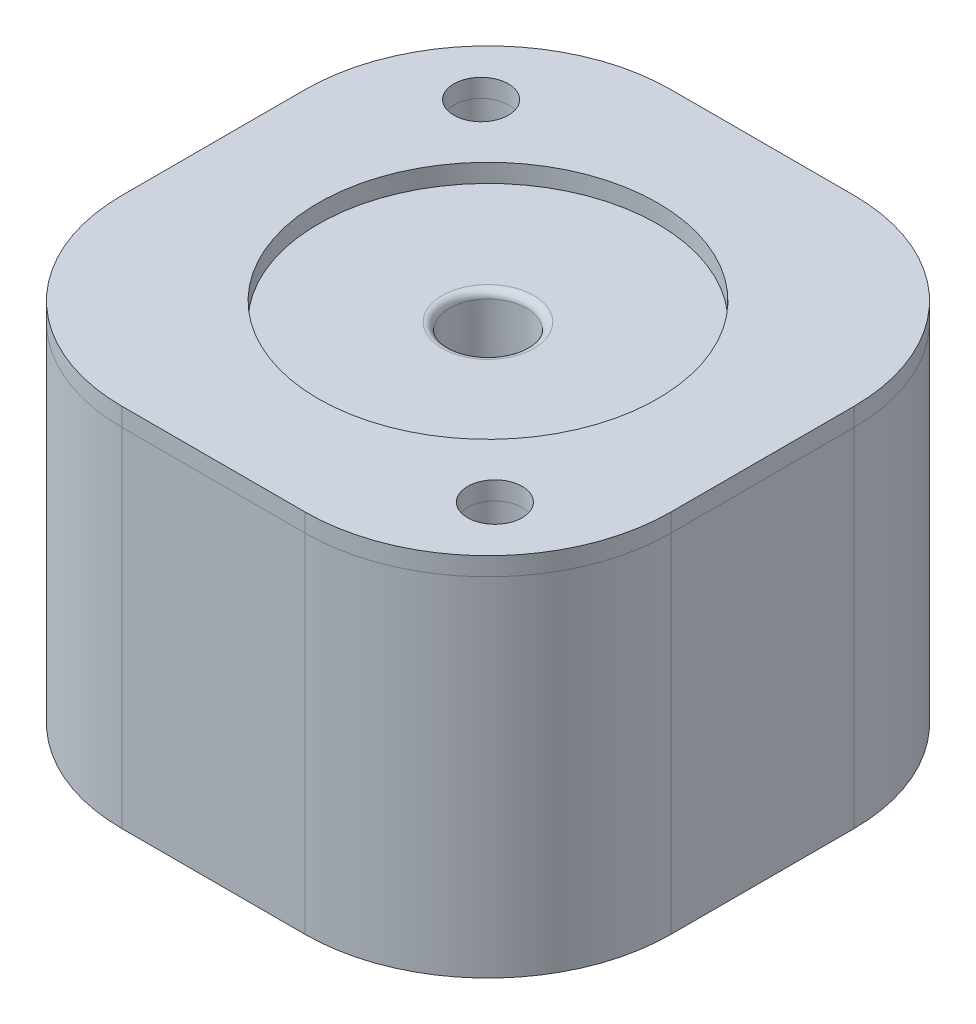
ISO-10303-21;
HEADER;
FILE_DESCRIPTION(('STEP AP214'),'2;1');
FILE_NAME('part.step','',(''),(''),'','','');
FILE_SCHEMA(('AUTOMOTIVE_DESIGN { 1 0 10303 214 1 1 1 1 }'));
ENDSEC;
DATA;
#1=APPLICATION_CONTEXT('core data for automotive mechanical design processes');
#2=APPLICATION_PROTOCOL_DEFINITION('international standard','automotive_design',2000,#1);
#3=PRODUCT_CONTEXT('',#1,'mechanical');
#4=PRODUCT('Part','Part','',(#3));
#5=PRODUCT_RELATED_PRODUCT_CATEGORY('part','',(#4));
#6=PRODUCT_DEFINITION_FORMATION('','',#4);
#7=PRODUCT_DEFINITION_CONTEXT('part definition',#1,'design');
#8=PRODUCT_DEFINITION('design','',#6,#7);
#9=PRODUCT_DEFINITION_SHAPE('','',#8);
#10=(LENGTH_UNIT() NAMED_UNIT(*) SI_UNIT(.MILLI.,.METRE.));
#11=(NAMED_UNIT(*) PLANE_ANGLE_UNIT() SI_UNIT($,.RADIAN.));
#12=(NAMED_UNIT(*) SI_UNIT($,.STERADIAN.) SOLID_ANGLE_UNIT());
#13=UNCERTAINTY_MEASURE_WITH_UNIT(LENGTH_MEASURE(1.E-05),#10,'distance_accuracy_value','');
#14=(GEOMETRIC_REPRESENTATION_CONTEXT(3) GLOBAL_UNCERTAINTY_ASSIGNED_CONTEXT((#13)) GLOBAL_UNIT_ASSIGNED_CONTEXT((#10,
#11,#12)) REPRESENTATION_CONTEXT('',''));
#15=CARTESIAN_POINT('',(0.,0.,0.));
#16=DIRECTION('',(0.,0.,1.));
#17=DIRECTION('',(1.,0.,0.));
#18=AXIS2_PLACEMENT_3D('',#15,#16,#17);
#19=CARTESIAN_POINT('',(-15.,19.,-15.01));
#20=DIRECTION('',(0.,-1.,0.));
#21=DIRECTION('',(0.,0.,-1.));
#22=AXIS2_PLACEMENT_3D('',#19,#20,#21);
#23=PLANE('',#22);
#24=CARTESIAN_POINT('',(0.,19.,0.));
#25=DIRECTION('',(0.,-1.,0.));
#26=DIRECTION('',(0.,0.,-1.));
#27=AXIS2_PLACEMENT_3D('',#24,#25,#26);
#28=CIRCLE('',#27,9.27774999999996);
#29=CARTESIAN_POINT('',(0.,19.,-9.27774999999995));
#30=VERTEX_POINT('',#29);
#31=EDGE_CURVE('E154',#30,#30,#28,.F.);
#32=ORIENTED_EDGE('',*,*,#31,.T.);
#33=EDGE_LOOP('',(#32));
#34=FACE_BOUND('',#33,.T.);
#35=CARTESIAN_POINT('',(-5.,19.,-4.99999999999999));
#36=DIRECTION('',(0.,-1.,0.));
#37=DIRECTION('',(0.,0.,-1.));
#38=AXIS2_PLACEMENT_3D('',#35,#36,#37);
#39=CIRCLE('',#38,10.);
#40=CARTESIAN_POINT('',(-5.,19.,-15.));
#41=VERTEX_POINT('',#40);
#42=CARTESIAN_POINT('',(-15.,19.,-4.99999999999999));
#43=VERTEX_POINT('',#42);
#44=EDGE_CURVE('E111',#41,#43,#39,.F.);
#45=ORIENTED_EDGE('',*,*,#44,.F.);
#46=DIRECTION('',(1.,0.,0.));
#47=VECTOR('',#46,1.);
#48=CARTESIAN_POINT('',(15.,19.,-15.));
#49=LINE('',#48,#47);
#50=CARTESIAN_POINT('',(4.99999999999999,19.,-15.));
#51=VERTEX_POINT('',#50);
#52=EDGE_CURVE('E157',#41,#51,#49,.T.);
#53=ORIENTED_EDGE('',*,*,#52,.T.);
#54=CARTESIAN_POINT('',(5.,19.,-4.99999999999999));
#55=DIRECTION('',(0.,-1.,0.));
#56=DIRECTION('',(0.,0.,-1.));
#57=AXIS2_PLACEMENT_3D('',#54,#55,#56);
#58=CIRCLE('',#57,10.);
#59=CARTESIAN_POINT('',(15.,19.,-4.99999999999999));
#60=VERTEX_POINT('',#59);
#61=EDGE_CURVE('E120',#60,#51,#58,.F.);
#62=ORIENTED_EDGE('',*,*,#61,.F.);
#63=DIRECTION('',(0.,0.,1.));
#64=VECTOR('',#63,1.);
#65=CARTESIAN_POINT('',(15.,19.,-15.));
#66=LINE('',#65,#64);
#67=CARTESIAN_POINT('',(15.,19.,5.));
#68=VERTEX_POINT('',#67);
#69=EDGE_CURVE('E159',#60,#68,#66,.T.);
#70=ORIENTED_EDGE('',*,*,#69,.T.);
#71=CARTESIAN_POINT('',(5.,19.,5.00000000000001));
#72=DIRECTION('',(0.,-1.,0.));
#73=DIRECTION('',(0.,0.,-1.));
#74=AXIS2_PLACEMENT_3D('',#71,#72,#73);
#75=CIRCLE('',#74,10.);
#76=CARTESIAN_POINT('',(5.,19.,15.));
#77=VERTEX_POINT('',#76);
#78=EDGE_CURVE('E147',#77,#68,#75,.F.);
#79=ORIENTED_EDGE('',*,*,#78,.F.);
#80=DIRECTION('',(-1.,0.,0.));
#81=VECTOR('',#80,1.);
#82=CARTESIAN_POINT('',(15.,19.,15.));
#83=LINE('',#82,#81);
#84=CARTESIAN_POINT('',(-5.,19.,15.));
#85=VERTEX_POINT('',#84);
#86=EDGE_CURVE('E126',#77,#85,#83,.T.);
#87=ORIENTED_EDGE('',*,*,#86,.T.);
#88=CARTESIAN_POINT('',(-5.,19.,5.00000000000001));
#89=DIRECTION('',(0.,-1.,0.));
#90=DIRECTION('',(0.,0.,-1.));
#91=AXIS2_PLACEMENT_3D('',#88,#89,#90);
#92=CIRCLE('',#91,10.);
#93=CARTESIAN_POINT('',(-15.,19.,5.00000000000001));
#94=VERTEX_POINT('',#93);
#95=EDGE_CURVE('E125',#94,#85,#92,.F.);
#96=ORIENTED_EDGE('',*,*,#95,.F.);
#97=DIRECTION('',(0.,0.,-1.));
#98=VECTOR('',#97,1.);
#99=CARTESIAN_POINT('',(-15.,19.,-15.));
#100=LINE('',#99,#98);
#101=EDGE_CURVE('E121',#94,#43,#100,.T.);
#102=ORIENTED_EDGE('',*,*,#101,.T.);
#103=EDGE_LOOP('',(#45,#53,#62,#70,#79,#87,#96,#102));
#104=FACE_BOUND('',#103,.T.);
#105=CARTESIAN_POINT('',(9.71815906597584,19.,9.34105517720241));
#106=DIRECTION('',(0.,-1.,0.));
#107=DIRECTION('',(0.,0.,-1.));
#108=AXIS2_PLACEMENT_3D('',#105,#106,#107);
#109=CIRCLE('',#108,1.49);
#110=CARTESIAN_POINT('',(9.71815906597584,19.,7.85105517720241));
#111=VERTEX_POINT('',#110);
#112=EDGE_CURVE('E148',#111,#111,#109,.F.);
#113=ORIENTED_EDGE('',*,*,#112,.T.);
#114=EDGE_LOOP('',(#113));
#115=FACE_BOUND('',#114,.T.);
#116=CARTESIAN_POINT('',(-9.71815906597584,19.,-9.34105517720241));
#117=DIRECTION('',(0.,-1.,0.));
#118=DIRECTION('',(0.,0.,-1.));
#119=AXIS2_PLACEMENT_3D('',#116,#117,#118);
#120=CIRCLE('',#119,1.49);
#121=CARTESIAN_POINT('',(-9.71815906597584,19.,-10.8310551772024));
#122=VERTEX_POINT('',#121);
#123=EDGE_CURVE('E151',#122,#122,#120,.F.);
#124=ORIENTED_EDGE('',*,*,#123,.T.);
#125=EDGE_LOOP('',(#124));
#126=FACE_BOUND('',#125,.T.);
#127=ADVANCED_FACE('F43',(#34,#104,#115,#126),#23,.T.);
#128=CARTESIAN_POINT('',(15.,20.,-15.));
#129=DIRECTION('',(0.,0.,1.));
#130=DIRECTION('',(1.,0.,0.));
#131=AXIS2_PLACEMENT_3D('',#128,#129,#130);
#132=PLANE('',#131);
#133=ORIENTED_EDGE('',*,*,#52,.F.);
#134=DIRECTION('',(0.,-1.,0.));
#135=VECTOR('',#134,1.);
#136=CARTESIAN_POINT('',(-5.,20.,-15.));
#137=LINE('',#136,#135);
#138=CARTESIAN_POINT('',(-5.,20.,-15.));
#139=VERTEX_POINT('',#138);
#140=EDGE_CURVE('E116',#41,#139,#137,.F.);
#141=ORIENTED_EDGE('',*,*,#140,.T.);
#142=DIRECTION('',(-1.,0.,0.));
#143=VECTOR('',#142,1.);
#144=CARTESIAN_POINT('',(15.,20.,-15.));
#145=LINE('',#144,#143);
#146=CARTESIAN_POINT('',(4.99999999999999,20.,-15.));
#147=VERTEX_POINT('',#146);
#148=EDGE_CURVE('E131',#147,#139,#145,.T.);
#149=ORIENTED_EDGE('',*,*,#148,.F.);
#150=DIRECTION('',(0.,-1.,0.));
#151=VECTOR('',#150,1.);
#152=CARTESIAN_POINT('',(4.99999999999999,20.,-15.));
#153=LINE('',#152,#151);
#154=EDGE_CURVE('E130',#147,#51,#153,.T.);
#155=ORIENTED_EDGE('',*,*,#154,.T.);
#156=EDGE_LOOP('',(#133,#141,#149,#155));
#157=FACE_BOUND('',#156,.T.);
#158=ADVANCED_FACE('F192',(#157),#132,.F.);
#159=CARTESIAN_POINT('',(0.,20.,0.));
#160=DIRECTION('',(0.,-1.,0.));
#161=DIRECTION('',(0.,0.,-1.));
#162=AXIS2_PLACEMENT_3D('',#159,#160,#161);
#163=PLANE('',#162);
#164=CARTESIAN_POINT('',(9.71815906597584,20.,9.34105517720241));
#165=DIRECTION('',(0.,1.,0.));
#166=DIRECTION('',(0.,0.,-1.));
#167=AXIS2_PLACEMENT_3D('',#164,#165,#166);
#168=CIRCLE('',#167,1.49);
#169=CARTESIAN_POINT('',(9.71815906597584,20.,7.85105517720241));
#170=VERTEX_POINT('',#169);
#171=EDGE_CURVE('E12',#170,#170,#168,.T.);
#172=ORIENTED_EDGE('',*,*,#171,.F.);
#173=EDGE_LOOP('',(#172));
#174=FACE_BOUND('',#173,.T.);
#175=CARTESIAN_POINT('',(-9.71815906597584,20.,-9.34105517720241));
#176=DIRECTION('',(0.,1.,0.));
#177=DIRECTION('',(0.,0.,1.));
#178=AXIS2_PLACEMENT_3D('',#175,#176,#177);
#179=CIRCLE('',#178,1.49);
#180=CARTESIAN_POINT('',(-9.71815906597584,20.,-7.85105517720241));
#181=VERTEX_POINT('',#180);
#182=EDGE_CURVE('E52',#181,#181,#179,.T.);
#183=ORIENTED_EDGE('',*,*,#182,.F.);
#184=EDGE_LOOP('',(#183));
#185=FACE_BOUND('',#184,.T.);
#186=CARTESIAN_POINT('',(0.,20.,0.));
#187=DIRECTION('',(0.,1.,0.));
#188=DIRECTION('',(0.,0.,1.));
#189=AXIS2_PLACEMENT_3D('',#186,#187,#188);
#190=CIRCLE('',#189,9.27774999999996);
#191=CARTESIAN_POINT('',(0.,20.,9.27774999999997));
#192=VERTEX_POINT('',#191);
#193=EDGE_CURVE('E168',#192,#192,#190,.T.);
#194=ORIENTED_EDGE('',*,*,#193,.F.);
#195=EDGE_LOOP('',(#194));
#196=FACE_BOUND('',#195,.T.);
#197=ORIENTED_EDGE('',*,*,#148,.T.);
#198=CARTESIAN_POINT('',(-5.,20.,-4.99999999999999));
#199=DIRECTION('',(0.,-1.,0.));
#200=DIRECTION('',(0.,0.,-1.));
#201=AXIS2_PLACEMENT_3D('',#198,#199,#200);
#202=CIRCLE('',#201,10.);
#203=CARTESIAN_POINT('',(-15.,20.,-4.99999999999999));
#204=VERTEX_POINT('',#203);
#205=EDGE_CURVE('E60',#139,#204,#202,.F.);
#206=ORIENTED_EDGE('',*,*,#205,.T.);
#207=DIRECTION('',(0.,0.,1.));
#208=VECTOR('',#207,1.);
#209=CARTESIAN_POINT('',(-15.,20.,-15.));
#210=LINE('',#209,#208);
#211=CARTESIAN_POINT('',(-15.,20.,5.00000000000001));
#212=VERTEX_POINT('',#211);
#213=EDGE_CURVE('E129',#204,#212,#210,.T.);
#214=ORIENTED_EDGE('',*,*,#213,.T.);
#215=CARTESIAN_POINT('',(-5.,20.,5.00000000000001));
#216=DIRECTION('',(0.,-1.,0.));
#217=DIRECTION('',(0.,0.,-1.));
#218=AXIS2_PLACEMENT_3D('',#215,#216,#217);
#219=CIRCLE('',#218,10.);
#220=CARTESIAN_POINT('',(-5.,20.,15.));
#221=VERTEX_POINT('',#220);
#222=EDGE_CURVE('E180',#212,#221,#219,.F.);
#223=ORIENTED_EDGE('',*,*,#222,.T.);
#224=DIRECTION('',(1.,0.,0.));
#225=VECTOR('',#224,1.);
#226=CARTESIAN_POINT('',(15.,20.,15.));
#227=LINE('',#226,#225);
#228=CARTESIAN_POINT('',(5.,20.,15.));
#229=VERTEX_POINT('',#228);
#230=EDGE_CURVE('E172',#221,#229,#227,.T.);
#231=ORIENTED_EDGE('',*,*,#230,.T.);
#232=CARTESIAN_POINT('',(5.,20.,5.00000000000001));
#233=DIRECTION('',(0.,-1.,0.));
#234=DIRECTION('',(0.,0.,-1.));
#235=AXIS2_PLACEMENT_3D('',#232,#233,#234);
#236=CIRCLE('',#235,10.);
#237=CARTESIAN_POINT('',(15.,20.,5.));
#238=VERTEX_POINT('',#237);
#239=EDGE_CURVE('E136',#229,#238,#236,.F.);
#240=ORIENTED_EDGE('',*,*,#239,.T.);
#241=DIRECTION('',(0.,0.,-1.));
#242=VECTOR('',#241,1.);
#243=CARTESIAN_POINT('',(15.,20.,-15.));
#244=LINE('',#243,#242);
#245=CARTESIAN_POINT('',(15.,20.,-4.99999999999999));
#246=VERTEX_POINT('',#245);
#247=EDGE_CURVE('E175',#238,#246,#244,.T.);
#248=ORIENTED_EDGE('',*,*,#247,.T.);
#249=CARTESIAN_POINT('',(5.,20.,-4.99999999999999));
#250=DIRECTION('',(0.,-1.,0.));
#251=DIRECTION('',(0.,0.,-1.));
#252=AXIS2_PLACEMENT_3D('',#249,#250,#251);
#253=CIRCLE('',#252,10.);
#254=EDGE_CURVE('E182',#246,#147,#253,.F.);
#255=ORIENTED_EDGE('',*,*,#254,.T.);
#256=EDGE_LOOP('',(#197,#206,#214,#223,#231,#240,#248,#255));
#257=FACE_BOUND('',#256,.T.);
#258=ADVANCED_FACE('F186',(#174,#185,#196,#257),#163,.F.);
#259=CARTESIAN_POINT('',(9.71815906597584,5.,9.34105517720241));
#260=DIRECTION('',(0.,1.,0.));
#261=DIRECTION('',(0.,0.,1.));
#262=AXIS2_PLACEMENT_3D('',#259,#260,#261);
#263=CYLINDRICAL_SURFACE('',#262,1.49);
#264=ORIENTED_EDGE('',*,*,#171,.T.);
#265=EDGE_LOOP('',(#264));
#266=FACE_BOUND('',#265,.T.);
#267=ORIENTED_EDGE('',*,*,#112,.F.);
#268=EDGE_LOOP('',(#267));
#269=FACE_BOUND('',#268,.T.);
#270=ADVANCED_FACE('F224',(#266,#269),#263,.F.);
#271=CARTESIAN_POINT('',(-9.71815906597584,5.,-9.34105517720241));
#272=DIRECTION('',(0.,1.,0.));
#273=DIRECTION('',(0.,0.,1.));
#274=AXIS2_PLACEMENT_3D('',#271,#272,#273);
#275=CYLINDRICAL_SURFACE('',#274,1.49);
#276=ORIENTED_EDGE('',*,*,#182,.T.);
#277=EDGE_LOOP('',(#276));
#278=FACE_BOUND('',#277,.T.);
#279=ORIENTED_EDGE('',*,*,#123,.F.);
#280=EDGE_LOOP('',(#279));
#281=FACE_BOUND('',#280,.T.);
#282=ADVANCED_FACE('F231',(#278,#281),#275,.F.);
#283=CARTESIAN_POINT('',(15.,20.,-15.));
#284=DIRECTION('',(-1.,0.,0.));
#285=DIRECTION('',(0.,0.,1.));
#286=AXIS2_PLACEMENT_3D('',#283,#284,#285);
#287=PLANE('',#286);
#288=ORIENTED_EDGE('',*,*,#69,.F.);
#289=DIRECTION('',(0.,-1.,0.));
#290=VECTOR('',#289,1.);
#291=CARTESIAN_POINT('',(15.,20.,-4.99999999999999));
#292=LINE('',#291,#290);
#293=EDGE_CURVE('E140',#60,#246,#292,.F.);
#294=ORIENTED_EDGE('',*,*,#293,.T.);
#295=ORIENTED_EDGE('',*,*,#247,.F.);
#296=DIRECTION('',(0.,-1.,0.));
#297=VECTOR('',#296,1.);
#298=CARTESIAN_POINT('',(15.,20.,5.));
#299=LINE('',#298,#297);
#300=EDGE_CURVE('E137',#238,#68,#299,.T.);
#301=ORIENTED_EDGE('',*,*,#300,.T.);
#302=EDGE_LOOP('',(#288,#294,#295,#301));
#303=FACE_BOUND('',#302,.T.);
#304=ADVANCED_FACE('F196',(#303),#287,.F.);
#305=CARTESIAN_POINT('',(15.,20.,15.));
#306=DIRECTION('',(0.,0.,-1.));
#307=DIRECTION('',(-1.,0.,0.));
#308=AXIS2_PLACEMENT_3D('',#305,#306,#307);
#309=PLANE('',#308);
#310=ORIENTED_EDGE('',*,*,#86,.F.);
#311=DIRECTION('',(0.,-1.,0.));
#312=VECTOR('',#311,1.);
#313=CARTESIAN_POINT('',(5.,20.,15.));
#314=LINE('',#313,#312);
#315=EDGE_CURVE('E142',#77,#229,#314,.F.);
#316=ORIENTED_EDGE('',*,*,#315,.T.);
#317=ORIENTED_EDGE('',*,*,#230,.F.);
#318=DIRECTION('',(0.,-1.,0.));
#319=VECTOR('',#318,1.);
#320=CARTESIAN_POINT('',(-5.,20.,15.));
#321=LINE('',#320,#319);
#322=EDGE_CURVE('E144',#221,#85,#321,.T.);
#323=ORIENTED_EDGE('',*,*,#322,.T.);
#324=EDGE_LOOP('',(#310,#316,#317,#323));
#325=FACE_BOUND('',#324,.T.);
#326=ADVANCED_FACE('F204',(#325),#309,.F.);
#327=CARTESIAN_POINT('',(5.,20.,5.00000000000001));
#328=DIRECTION('',(0.,-1.,0.));
#329=DIRECTION('',(0.,0.,-1.));
#330=AXIS2_PLACEMENT_3D('',#327,#328,#329);
#331=CYLINDRICAL_SURFACE('',#330,10.);
#332=ORIENTED_EDGE('',*,*,#315,.F.);
#333=ORIENTED_EDGE('',*,*,#78,.T.);
#334=ORIENTED_EDGE('',*,*,#300,.F.);
#335=ORIENTED_EDGE('',*,*,#239,.F.);
#336=EDGE_LOOP('',(#332,#333,#334,#335));
#337=FACE_BOUND('',#336,.T.);
#338=ADVANCED_FACE('F201',(#337),#331,.T.);
#339=CARTESIAN_POINT('',(-15.,20.,-15.));
#340=DIRECTION('',(1.,0.,0.));
#341=DIRECTION('',(0.,0.,-1.));
#342=AXIS2_PLACEMENT_3D('',#339,#340,#341);
#343=PLANE('',#342);
#344=ORIENTED_EDGE('',*,*,#101,.F.);
#345=DIRECTION('',(0.,-1.,0.));
#346=VECTOR('',#345,1.);
#347=CARTESIAN_POINT('',(-15.,20.,5.00000000000001));
#348=LINE('',#347,#346);
#349=EDGE_CURVE('E47',#94,#212,#348,.F.);
#350=ORIENTED_EDGE('',*,*,#349,.T.);
#351=ORIENTED_EDGE('',*,*,#213,.F.);
#352=DIRECTION('',(0.,-1.,0.));
#353=VECTOR('',#352,1.);
#354=CARTESIAN_POINT('',(-15.,20.,-4.99999999999999));
#355=LINE('',#354,#353);
#356=EDGE_CURVE('E115',#204,#43,#355,.T.);
#357=ORIENTED_EDGE('',*,*,#356,.T.);
#358=EDGE_LOOP('',(#344,#350,#351,#357));
#359=FACE_BOUND('',#358,.T.);
#360=ADVANCED_FACE('F128',(#359),#343,.F.);
#361=CARTESIAN_POINT('',(-5.,20.,5.00000000000001));
#362=DIRECTION('',(0.,-1.,0.));
#363=DIRECTION('',(0.,0.,-1.));
#364=AXIS2_PLACEMENT_3D('',#361,#362,#363);
#365=CYLINDRICAL_SURFACE('',#364,10.);
#366=ORIENTED_EDGE('',*,*,#349,.F.);
#367=ORIENTED_EDGE('',*,*,#95,.T.);
#368=ORIENTED_EDGE('',*,*,#322,.F.);
#369=ORIENTED_EDGE('',*,*,#222,.F.);
#370=EDGE_LOOP('',(#366,#367,#368,#369));
#371=FACE_BOUND('',#370,.T.);
#372=ADVANCED_FACE('F209',(#371),#365,.T.);
#373=CARTESIAN_POINT('',(5.,20.,-4.99999999999999));
#374=DIRECTION('',(0.,-1.,0.));
#375=DIRECTION('',(0.,0.,-1.));
#376=AXIS2_PLACEMENT_3D('',#373,#374,#375);
#377=CYLINDRICAL_SURFACE('',#376,10.);
#378=ORIENTED_EDGE('',*,*,#293,.F.);
#379=ORIENTED_EDGE('',*,*,#61,.T.);
#380=ORIENTED_EDGE('',*,*,#154,.F.);
#381=ORIENTED_EDGE('',*,*,#254,.F.);
#382=EDGE_LOOP('',(#378,#379,#380,#381));
#383=FACE_BOUND('',#382,.T.);
#384=ADVANCED_FACE('F193',(#383),#377,.T.);
#385=CARTESIAN_POINT('',(-5.,20.,-4.99999999999999));
#386=DIRECTION('',(0.,-1.,0.));
#387=DIRECTION('',(0.,0.,-1.));
#388=AXIS2_PLACEMENT_3D('',#385,#386,#387);
#389=CYLINDRICAL_SURFACE('',#388,10.);
#390=ORIENTED_EDGE('',*,*,#140,.F.);
#391=ORIENTED_EDGE('',*,*,#44,.T.);
#392=ORIENTED_EDGE('',*,*,#356,.F.);
#393=ORIENTED_EDGE('',*,*,#205,.F.);
#394=EDGE_LOOP('',(#390,#391,#392,#393));
#395=FACE_BOUND('',#394,.T.);
#396=ADVANCED_FACE('F113',(#395),#389,.T.);
#397=CARTESIAN_POINT('',(0.,320.443462068965,0.));
#398=DIRECTION('',(0.,1.,0.));
#399=DIRECTION('',(0.,0.,1.));
#400=AXIS2_PLACEMENT_3D('',#397,#398,#399);
#401=CYLINDRICAL_SURFACE('',#400,9.27774999999996);
#402=ORIENTED_EDGE('',*,*,#193,.T.);
#403=EDGE_LOOP('',(#402));
#404=FACE_BOUND('',#403,.T.);
#405=ORIENTED_EDGE('',*,*,#31,.F.);
#406=EDGE_LOOP('',(#405));
#407=FACE_BOUND('',#406,.T.);
#408=ADVANCED_FACE('F45',(#404,#407),#401,.F.);
#409=CLOSED_SHELL('',(#127,#158,#258,#270,#282,#304,#326,#338,#360,#372,#384,#396,#408));
#410=MANIFOLD_SOLID_BREP('B2',#409);
#411=CARTESIAN_POINT('',(-15.,19.,-15.01));
#412=DIRECTION('',(0.,-1.,0.));
#413=DIRECTION('',(0.,0.,-1.));
#414=AXIS2_PLACEMENT_3D('',#411,#412,#413);
#415=PLANE('',#414);
#416=CARTESIAN_POINT('',(-9.71815906597584,19.,-9.34105517720241));
#417=DIRECTION('',(0.,-1.,0.));
#418=DIRECTION('',(0.,0.,-1.));
#419=AXIS2_PLACEMENT_3D('',#416,#417,#418);
#420=CIRCLE('',#419,1.49);
#421=CARTESIAN_POINT('',(-9.71815906597584,19.,-10.8310551772024));
#422=VERTEX_POINT('',#421);
#423=EDGE_CURVE('E463',#422,#422,#420,.F.);
#424=ORIENTED_EDGE('',*,*,#423,.F.);
#425=EDGE_LOOP('',(#424));
#426=FACE_BOUND('',#425,.T.);
#427=CARTESIAN_POINT('',(9.71815906597584,19.,9.34105517720241));
#428=DIRECTION('',(0.,-1.,0.));
#429=DIRECTION('',(0.,0.,-1.));
#430=AXIS2_PLACEMENT_3D('',#427,#428,#429);
#431=CIRCLE('',#430,1.49);
#432=CARTESIAN_POINT('',(9.71815906597584,19.,7.85105517720241));
#433=VERTEX_POINT('',#432);
#434=EDGE_CURVE('E460',#433,#433,#431,.F.);
#435=ORIENTED_EDGE('',*,*,#434,.F.);
#436=EDGE_LOOP('',(#435));
#437=FACE_BOUND('',#436,.T.);
#438=CARTESIAN_POINT('',(-5.,19.,-4.99999999999999));
#439=DIRECTION('',(0.,-1.,0.));
#440=DIRECTION('',(0.,0.,-1.));
#441=AXIS2_PLACEMENT_3D('',#438,#439,#440);
#442=CIRCLE('',#441,10.);
#443=CARTESIAN_POINT('',(-5.,19.,-15.));
#444=VERTEX_POINT('',#443);
#445=CARTESIAN_POINT('',(-15.,19.,-4.99999999999999));
#446=VERTEX_POINT('',#445);
#447=EDGE_CURVE('E469',#444,#446,#442,.F.);
#448=ORIENTED_EDGE('',*,*,#447,.T.);
#449=DIRECTION('',(0.,0.,-1.));
#450=VECTOR('',#449,1.);
#451=CARTESIAN_POINT('',(-15.,19.,-15.));
#452=LINE('',#451,#450);
#453=CARTESIAN_POINT('',(-15.,19.,5.00000000000001));
#454=VERTEX_POINT('',#453);
#455=EDGE_CURVE('E408',#454,#446,#452,.T.);
#456=ORIENTED_EDGE('',*,*,#455,.F.);
#457=CARTESIAN_POINT('',(-5.,19.,5.00000000000001));
#458=DIRECTION('',(0.,-1.,0.));
#459=DIRECTION('',(0.,0.,-1.));
#460=AXIS2_PLACEMENT_3D('',#457,#458,#459);
#461=CIRCLE('',#460,10.);
#462=CARTESIAN_POINT('',(-5.,19.,15.));
#463=VERTEX_POINT('',#462);
#464=EDGE_CURVE('E342',#454,#463,#461,.F.);
#465=ORIENTED_EDGE('',*,*,#464,.T.);
#466=DIRECTION('',(-1.,0.,0.));
#467=VECTOR('',#466,1.);
#468=CARTESIAN_POINT('',(15.,19.,15.));
#469=LINE('',#468,#467);
#470=CARTESIAN_POINT('',(5.,19.,15.));
#471=VERTEX_POINT('',#470);
#472=EDGE_CURVE('E465',#471,#463,#469,.T.);
#473=ORIENTED_EDGE('',*,*,#472,.F.);
#474=CARTESIAN_POINT('',(5.,19.,5.00000000000001));
#475=DIRECTION('',(0.,-1.,0.));
#476=DIRECTION('',(0.,0.,-1.));
#477=AXIS2_PLACEMENT_3D('',#474,#475,#476);
#478=CIRCLE('',#477,10.);
#479=CARTESIAN_POINT('',(15.,19.,5.));
#480=VERTEX_POINT('',#479);
#481=EDGE_CURVE('E41',#471,#480,#478,.F.);
#482=ORIENTED_EDGE('',*,*,#481,.T.);
#483=DIRECTION('',(0.,0.,1.));
#484=VECTOR('',#483,1.);
#485=CARTESIAN_POINT('',(15.,19.,-15.));
#486=LINE('',#485,#484);
#487=CARTESIAN_POINT('',(15.,19.,-4.99999999999999));
#488=VERTEX_POINT('',#487);
#489=EDGE_CURVE('E356',#488,#480,#486,.T.);
#490=ORIENTED_EDGE('',*,*,#489,.F.);
#491=CARTESIAN_POINT('',(5.,19.,-4.99999999999999));
#492=DIRECTION('',(0.,-1.,0.));
#493=DIRECTION('',(0.,0.,-1.));
#494=AXIS2_PLACEMENT_3D('',#491,#492,#493);
#495=CIRCLE('',#494,10.);
#496=CARTESIAN_POINT('',(4.99999999999999,19.,-15.));
#497=VERTEX_POINT('',#496);
#498=EDGE_CURVE('E474',#488,#497,#495,.F.);
#499=ORIENTED_EDGE('',*,*,#498,.T.);
#500=DIRECTION('',(1.,0.,0.));
#501=VECTOR('',#500,1.);
#502=CARTESIAN_POINT('',(15.,19.,-15.));
#503=LINE('',#502,#501);
#504=EDGE_CURVE('E466',#444,#497,#503,.T.);
#505=ORIENTED_EDGE('',*,*,#504,.F.);
#506=EDGE_LOOP('',(#448,#456,#465,#473,#482,#490,#499,#505));
#507=FACE_BOUND('',#506,.T.);
#508=CARTESIAN_POINT('',(0.,19.,0.));
#509=DIRECTION('',(0.,-1.,0.));
#510=DIRECTION('',(0.,0.,-1.));
#511=AXIS2_PLACEMENT_3D('',#508,#509,#510);
#512=CIRCLE('',#511,9.27774999999996);
#513=CARTESIAN_POINT('',(0.,19.,-9.27774999999995));
#514=VERTEX_POINT('',#513);
#515=EDGE_CURVE('E337',#514,#514,#512,.F.);
#516=ORIENTED_EDGE('',*,*,#515,.F.);
#517=EDGE_LOOP('',(#516));
#518=FACE_BOUND('',#517,.T.);
#519=ADVANCED_FACE('F334',(#426,#437,#507,#518),#415,.F.);
#520=CARTESIAN_POINT('',(9.71815906597584,5.,9.34105517720241));
#521=DIRECTION('',(0.,1.,0.));
#522=DIRECTION('',(0.,0.,-1.));
#523=AXIS2_PLACEMENT_3D('',#520,#521,#522);
#524=PLANE('',#523);
#525=CARTESIAN_POINT('',(9.71815906597584,5.,9.34105517720241));
#526=DIRECTION('',(0.,1.,0.));
#527=DIRECTION('',(0.,0.,-1.));
#528=AXIS2_PLACEMENT_3D('',#525,#526,#527);
#529=CIRCLE('',#528,1.49);
#530=CARTESIAN_POINT('',(9.71815906597584,5.,7.85105517720241));
#531=VERTEX_POINT('',#530);
#532=EDGE_CURVE('E583',#531,#531,#529,.T.);
#533=ORIENTED_EDGE('',*,*,#532,.T.);
#534=EDGE_LOOP('',(#533));
#535=FACE_BOUND('',#534,.T.);
#536=ADVANCED_FACE('F504',(#535),#524,.T.);
#537=CARTESIAN_POINT('',(9.71815906597584,5.,9.34105517720241));
#538=DIRECTION('',(0.,1.,0.));
#539=DIRECTION('',(0.,0.,1.));
#540=AXIS2_PLACEMENT_3D('',#537,#538,#539);
#541=CYLINDRICAL_SURFACE('',#540,1.49);
#542=ORIENTED_EDGE('',*,*,#434,.T.);
#543=EDGE_LOOP('',(#542));
#544=FACE_BOUND('',#543,.T.);
#545=ORIENTED_EDGE('',*,*,#532,.F.);
#546=EDGE_LOOP('',(#545));
#547=FACE_BOUND('',#546,.T.);
#548=ADVANCED_FACE('F510',(#544,#547),#541,.F.);
#549=CARTESIAN_POINT('',(-9.71815906597584,5.,-9.34105517720241));
#550=DIRECTION('',(0.,1.,0.));
#551=DIRECTION('',(0.,0.,1.));
#552=AXIS2_PLACEMENT_3D('',#549,#550,#551);
#553=PLANE('',#552);
#554=CARTESIAN_POINT('',(-9.71815906597584,5.,-9.34105517720241));
#555=DIRECTION('',(0.,1.,0.));
#556=DIRECTION('',(0.,0.,1.));
#557=AXIS2_PLACEMENT_3D('',#554,#555,#556);
#558=CIRCLE('',#557,1.49);
#559=CARTESIAN_POINT('',(-9.71815906597584,5.,-7.85105517720241));
#560=VERTEX_POINT('',#559);
#561=EDGE_CURVE('E584',#560,#560,#558,.T.);
#562=ORIENTED_EDGE('',*,*,#561,.T.);
#563=EDGE_LOOP('',(#562));
#564=FACE_BOUND('',#563,.T.);
#565=ADVANCED_FACE('F570',(#564),#553,.T.);
#566=CARTESIAN_POINT('',(-9.71815906597584,5.,-9.34105517720241));
#567=DIRECTION('',(0.,1.,0.));
#568=DIRECTION('',(0.,0.,1.));
#569=AXIS2_PLACEMENT_3D('',#566,#567,#568);
#570=CYLINDRICAL_SURFACE('',#569,1.49);
#571=ORIENTED_EDGE('',*,*,#423,.T.);
#572=EDGE_LOOP('',(#571));
#573=FACE_BOUND('',#572,.T.);
#574=ORIENTED_EDGE('',*,*,#561,.F.);
#575=EDGE_LOOP('',(#574));
#576=FACE_BOUND('',#575,.T.);
#577=ADVANCED_FACE('F533',(#573,#576),#570,.F.);
#578=CARTESIAN_POINT('',(15.,20.,-15.));
#579=DIRECTION('',(0.,0.,1.));
#580=DIRECTION('',(1.,0.,0.));
#581=AXIS2_PLACEMENT_3D('',#578,#579,#580);
#582=PLANE('',#581);
#583=DIRECTION('',(0.,-1.,0.));
#584=VECTOR('',#583,1.);
#585=CARTESIAN_POINT('',(-5.,20.,-15.));
#586=LINE('',#585,#584);
#587=CARTESIAN_POINT('',(-5.,0.,-15.));
#588=VERTEX_POINT('',#587);
#589=EDGE_CURVE('E419',#588,#444,#586,.F.);
#590=ORIENTED_EDGE('',*,*,#589,.T.);
#591=ORIENTED_EDGE('',*,*,#504,.T.);
#592=DIRECTION('',(0.,-1.,0.));
#593=VECTOR('',#592,1.);
#594=CARTESIAN_POINT('',(4.99999999999999,20.,-15.));
#595=LINE('',#594,#593);
#596=CARTESIAN_POINT('',(4.99999999999999,0.,-15.));
#597=VERTEX_POINT('',#596);
#598=EDGE_CURVE('E423',#497,#597,#595,.T.);
#599=ORIENTED_EDGE('',*,*,#598,.T.);
#600=DIRECTION('',(-1.,0.,0.));
#601=VECTOR('',#600,1.);
#602=CARTESIAN_POINT('',(15.,0.,-15.));
#603=LINE('',#602,#601);
#604=EDGE_CURVE('E443',#597,#588,#603,.T.);
#605=ORIENTED_EDGE('',*,*,#604,.T.);
#606=EDGE_LOOP('',(#590,#591,#599,#605));
#607=FACE_BOUND('',#606,.T.);
#608=ADVANCED_FACE('F480',(#607),#582,.F.);
#609=CARTESIAN_POINT('',(15.,20.,-15.));
#610=DIRECTION('',(-1.,0.,0.));
#611=DIRECTION('',(0.,0.,1.));
#612=AXIS2_PLACEMENT_3D('',#609,#610,#611);
#613=PLANE('',#612);
#614=DIRECTION('',(0.,-1.,0.));
#615=VECTOR('',#614,1.);
#616=CARTESIAN_POINT('',(15.,20.,-4.99999999999999));
#617=LINE('',#616,#615);
#618=CARTESIAN_POINT('',(15.,0.,-4.99999999999999));
#619=VERTEX_POINT('',#618);
#620=EDGE_CURVE('E453',#619,#488,#617,.F.);
#621=ORIENTED_EDGE('',*,*,#620,.T.);
#622=ORIENTED_EDGE('',*,*,#489,.T.);
#623=DIRECTION('',(0.,-1.,0.));
#624=VECTOR('',#623,1.);
#625=CARTESIAN_POINT('',(15.,20.,5.));
#626=LINE('',#625,#624);
#627=CARTESIAN_POINT('',(15.,0.,5.));
#628=VERTEX_POINT('',#627);
#629=EDGE_CURVE('E451',#480,#628,#626,.T.);
#630=ORIENTED_EDGE('',*,*,#629,.T.);
#631=DIRECTION('',(0.,0.,-1.));
#632=VECTOR('',#631,1.);
#633=CARTESIAN_POINT('',(15.,0.,-15.));
#634=LINE('',#633,#632);
#635=EDGE_CURVE('E434',#628,#619,#634,.T.);
#636=ORIENTED_EDGE('',*,*,#635,.T.);
#637=EDGE_LOOP('',(#621,#622,#630,#636));
#638=FACE_BOUND('',#637,.T.);
#639=ADVANCED_FACE('F486',(#638),#613,.F.);
#640=CARTESIAN_POINT('',(0.,0.,0.));
#641=DIRECTION('',(0.,-1.,0.));
#642=DIRECTION('',(0.,0.,-1.));
#643=AXIS2_PLACEMENT_3D('',#640,#641,#642);
#644=PLANE('',#643);
#645=DIRECTION('',(0.,0.,1.));
#646=VECTOR('',#645,1.);
#647=CARTESIAN_POINT('',(-15.,0.,-15.));
#648=LINE('',#647,#646);
#649=CARTESIAN_POINT('',(-15.,0.,-4.99999999999999));
#650=VERTEX_POINT('',#649);
#651=CARTESIAN_POINT('',(-15.,0.,5.00000000000001));
#652=VERTEX_POINT('',#651);
#653=EDGE_CURVE('E405',#650,#652,#648,.T.);
#654=ORIENTED_EDGE('',*,*,#653,.F.);
#655=CARTESIAN_POINT('',(-5.,0.,-4.99999999999999));
#656=DIRECTION('',(0.,-1.,0.));
#657=DIRECTION('',(0.,0.,-1.));
#658=AXIS2_PLACEMENT_3D('',#655,#656,#657);
#659=CIRCLE('',#658,10.);
#660=EDGE_CURVE('E416',#650,#588,#659,.T.);
#661=ORIENTED_EDGE('',*,*,#660,.T.);
#662=ORIENTED_EDGE('',*,*,#604,.F.);
#663=CARTESIAN_POINT('',(5.,0.,-4.99999999999999));
#664=DIRECTION('',(0.,-1.,0.));
#665=DIRECTION('',(0.,0.,-1.));
#666=AXIS2_PLACEMENT_3D('',#663,#664,#665);
#667=CIRCLE('',#666,10.);
#668=EDGE_CURVE('E424',#597,#619,#667,.T.);
#669=ORIENTED_EDGE('',*,*,#668,.T.);
#670=ORIENTED_EDGE('',*,*,#635,.F.);
#671=CARTESIAN_POINT('',(5.,0.,5.00000000000001));
#672=DIRECTION('',(0.,-1.,0.));
#673=DIRECTION('',(0.,0.,-1.));
#674=AXIS2_PLACEMENT_3D('',#671,#672,#673);
#675=CIRCLE('',#674,10.);
#676=CARTESIAN_POINT('',(5.,0.,15.));
#677=VERTEX_POINT('',#676);
#678=EDGE_CURVE('E412',#628,#677,#675,.T.);
#679=ORIENTED_EDGE('',*,*,#678,.T.);
#680=DIRECTION('',(1.,0.,0.));
#681=VECTOR('',#680,1.);
#682=CARTESIAN_POINT('',(15.,0.,15.));
#683=LINE('',#682,#681);
#684=CARTESIAN_POINT('',(-5.,0.,15.));
#685=VERTEX_POINT('',#684);
#686=EDGE_CURVE('E430',#685,#677,#683,.T.);
#687=ORIENTED_EDGE('',*,*,#686,.F.);
#688=CARTESIAN_POINT('',(-5.,0.,5.00000000000001));
#689=DIRECTION('',(0.,-1.,0.));
#690=DIRECTION('',(0.,0.,-1.));
#691=AXIS2_PLACEMENT_3D('',#688,#689,#690);
#692=CIRCLE('',#691,10.);
#693=EDGE_CURVE('E429',#685,#652,#692,.T.);
#694=ORIENTED_EDGE('',*,*,#693,.T.);
#695=EDGE_LOOP('',(#654,#661,#662,#669,#670,#679,#687,#694));
#696=FACE_BOUND('',#695,.T.);
#697=ADVANCED_FACE('F426',(#696),#644,.T.);
#698=CARTESIAN_POINT('',(15.,20.,15.));
#699=DIRECTION('',(0.,0.,-1.));
#700=DIRECTION('',(-1.,0.,0.));
#701=AXIS2_PLACEMENT_3D('',#698,#699,#700);
#702=PLANE('',#701);
#703=DIRECTION('',(0.,-1.,0.));
#704=VECTOR('',#703,1.);
#705=CARTESIAN_POINT('',(5.,20.,15.));
#706=LINE('',#705,#704);
#707=EDGE_CURVE('E455',#677,#471,#706,.F.);
#708=ORIENTED_EDGE('',*,*,#707,.T.);
#709=ORIENTED_EDGE('',*,*,#472,.T.);
#710=DIRECTION('',(0.,-1.,0.));
#711=VECTOR('',#710,1.);
#712=CARTESIAN_POINT('',(-5.,20.,15.));
#713=LINE('',#712,#711);
#714=EDGE_CURVE('E458',#463,#685,#713,.T.);
#715=ORIENTED_EDGE('',*,*,#714,.T.);
#716=ORIENTED_EDGE('',*,*,#686,.T.);
#717=EDGE_LOOP('',(#708,#709,#715,#716));
#718=FACE_BOUND('',#717,.T.);
#719=ADVANCED_FACE('F491',(#718),#702,.F.);
#720=CARTESIAN_POINT('',(5.,20.,5.00000000000001));
#721=DIRECTION('',(0.,-1.,0.));
#722=DIRECTION('',(0.,0.,-1.));
#723=AXIS2_PLACEMENT_3D('',#720,#721,#722);
#724=CYLINDRICAL_SURFACE('',#723,10.);
#725=ORIENTED_EDGE('',*,*,#481,.F.);
#726=ORIENTED_EDGE('',*,*,#707,.F.);
#727=ORIENTED_EDGE('',*,*,#678,.F.);
#728=ORIENTED_EDGE('',*,*,#629,.F.);
#729=EDGE_LOOP('',(#725,#726,#727,#728));
#730=FACE_BOUND('',#729,.T.);
#731=ADVANCED_FACE('F489',(#730),#724,.T.);
#732=CARTESIAN_POINT('',(-15.,20.,-15.));
#733=DIRECTION('',(1.,0.,0.));
#734=DIRECTION('',(0.,0.,-1.));
#735=AXIS2_PLACEMENT_3D('',#732,#733,#734);
#736=PLANE('',#735);
#737=DIRECTION('',(0.,-1.,0.));
#738=VECTOR('',#737,1.);
#739=CARTESIAN_POINT('',(-15.,20.,5.00000000000001));
#740=LINE('',#739,#738);
#741=EDGE_CURVE('E413',#652,#454,#740,.F.);
#742=ORIENTED_EDGE('',*,*,#741,.T.);
#743=ORIENTED_EDGE('',*,*,#455,.T.);
#744=DIRECTION('',(0.,-1.,0.));
#745=VECTOR('',#744,1.);
#746=CARTESIAN_POINT('',(-15.,20.,-4.99999999999999));
#747=LINE('',#746,#745);
#748=EDGE_CURVE('E400',#446,#650,#747,.T.);
#749=ORIENTED_EDGE('',*,*,#748,.T.);
#750=ORIENTED_EDGE('',*,*,#653,.T.);
#751=EDGE_LOOP('',(#742,#743,#749,#750));
#752=FACE_BOUND('',#751,.T.);
#753=ADVANCED_FACE('F403',(#752),#736,.F.);
#754=CARTESIAN_POINT('',(-5.,20.,5.00000000000001));
#755=DIRECTION('',(0.,-1.,0.));
#756=DIRECTION('',(0.,0.,-1.));
#757=AXIS2_PLACEMENT_3D('',#754,#755,#756);
#758=CYLINDRICAL_SURFACE('',#757,10.);
#759=ORIENTED_EDGE('',*,*,#464,.F.);
#760=ORIENTED_EDGE('',*,*,#741,.F.);
#761=ORIENTED_EDGE('',*,*,#693,.F.);
#762=ORIENTED_EDGE('',*,*,#714,.F.);
#763=EDGE_LOOP('',(#759,#760,#761,#762));
#764=FACE_BOUND('',#763,.T.);
#765=ADVANCED_FACE('F494',(#764),#758,.T.);
#766=CARTESIAN_POINT('',(5.,20.,-4.99999999999999));
#767=DIRECTION('',(0.,-1.,0.));
#768=DIRECTION('',(0.,0.,-1.));
#769=AXIS2_PLACEMENT_3D('',#766,#767,#768);
#770=CYLINDRICAL_SURFACE('',#769,10.);
#771=ORIENTED_EDGE('',*,*,#498,.F.);
#772=ORIENTED_EDGE('',*,*,#620,.F.);
#773=ORIENTED_EDGE('',*,*,#668,.F.);
#774=ORIENTED_EDGE('',*,*,#598,.F.);
#775=EDGE_LOOP('',(#771,#772,#773,#774));
#776=FACE_BOUND('',#775,.T.);
#777=ADVANCED_FACE('F488',(#776),#770,.T.);
#778=CARTESIAN_POINT('',(-5.,20.,-4.99999999999999));
#779=DIRECTION('',(0.,-1.,0.));
#780=DIRECTION('',(0.,0.,-1.));
#781=AXIS2_PLACEMENT_3D('',#778,#779,#780);
#782=CYLINDRICAL_SURFACE('',#781,10.);
#783=ORIENTED_EDGE('',*,*,#447,.F.);
#784=ORIENTED_EDGE('',*,*,#589,.F.);
#785=ORIENTED_EDGE('',*,*,#660,.F.);
#786=ORIENTED_EDGE('',*,*,#748,.F.);
#787=EDGE_LOOP('',(#783,#784,#785,#786));
#788=FACE_BOUND('',#787,.T.);
#789=ADVANCED_FACE('F417',(#788),#782,.T.);
#790=CARTESIAN_POINT('',(0.,320.443462068965,0.));
#791=DIRECTION('',(0.,1.,0.));
#792=DIRECTION('',(0.,0.,1.));
#793=AXIS2_PLACEMENT_3D('',#790,#791,#792);
#794=CYLINDRICAL_SURFACE('',#793,9.27774999999996);
#795=ORIENTED_EDGE('',*,*,#515,.T.);
#796=EDGE_LOOP('',(#795));
#797=FACE_BOUND('',#796,.T.);
#798=CARTESIAN_POINT('',(0.,18.997,0.));
#799=DIRECTION('',(0.,1.,0.));
#800=DIRECTION('',(0.,0.,1.));
#801=AXIS2_PLACEMENT_3D('',#798,#799,#800);
#802=CIRCLE('',#801,9.27774999999996);
#803=CARTESIAN_POINT('',(0.,18.997,9.27774999999997));
#804=VERTEX_POINT('',#803);
#805=EDGE_CURVE('E595',#804,#804,#802,.T.);
#806=ORIENTED_EDGE('',*,*,#805,.F.);
#807=EDGE_LOOP('',(#806));
#808=FACE_BOUND('',#807,.T.);
#809=ADVANCED_FACE('F539',(#797,#808),#794,.F.);
#810=CARTESIAN_POINT('',(-9.27774999999996,18.997,0.));
#811=DIRECTION('',(0.,-1.,0.));
#812=DIRECTION('',(0.,0.,-1.));
#813=AXIS2_PLACEMENT_3D('',#810,#811,#812);
#814=PLANE('',#813);
#815=CARTESIAN_POINT('',(0.,18.997,0.));
#816=DIRECTION('',(0.,-1.,0.));
#817=DIRECTION('',(0.,0.,-1.));
#818=AXIS2_PLACEMENT_3D('',#815,#816,#817);
#819=CIRCLE('',#818,2.50749999999996);
#820=CARTESIAN_POINT('',(0.,18.997,-2.50749999999996));
#821=VERTEX_POINT('',#820);
#822=EDGE_CURVE('E431',#821,#821,#819,.F.);
#823=ORIENTED_EDGE('',*,*,#822,.F.);
#824=EDGE_LOOP('',(#823));
#825=FACE_BOUND('',#824,.T.);
#826=ORIENTED_EDGE('',*,*,#805,.T.);
#827=EDGE_LOOP('',(#826));
#828=FACE_BOUND('',#827,.T.);
#829=ADVANCED_FACE('F543',(#825,#828),#814,.F.);
#830=CARTESIAN_POINT('',(0.,320.443462068965,0.));
#831=DIRECTION('',(0.,1.,0.));
#832=DIRECTION('',(0.,0.,1.));
#833=AXIS2_PLACEMENT_3D('',#830,#831,#832);
#834=CYLINDRICAL_SURFACE('',#833,2.10629999999996);
#835=CARTESIAN_POINT('',(0.,15.3862,0.));
#836=DIRECTION('',(0.,1.,0.));
#837=DIRECTION('',(0.,0.,1.));
#838=AXIS2_PLACEMENT_3D('',#835,#836,#837);
#839=CIRCLE('',#838,2.10629999999996);
#840=CARTESIAN_POINT('',(0.,15.3862,2.10629999999997));
#841=VERTEX_POINT('',#840);
#842=EDGE_CURVE('E600',#841,#841,#839,.T.);
#843=ORIENTED_EDGE('',*,*,#842,.F.);
#844=EDGE_LOOP('',(#843));
#845=FACE_BOUND('',#844,.T.);
#846=CARTESIAN_POINT('',(0.,18.5958,0.));
#847=DIRECTION('',(0.,-1.,0.));
#848=DIRECTION('',(0.,0.,-1.));
#849=AXIS2_PLACEMENT_3D('',#846,#847,#848);
#850=CIRCLE('',#849,2.10629999999996);
#851=CARTESIAN_POINT('',(0.,18.5958,-2.10629999999996));
#852=VERTEX_POINT('',#851);
#853=EDGE_CURVE('E598',#852,#852,#850,.T.);
#854=ORIENTED_EDGE('',*,*,#853,.F.);
#855=EDGE_LOOP('',(#854));
#856=FACE_BOUND('',#855,.T.);
#857=ADVANCED_FACE('F548',(#845,#856),#834,.F.);
#858=CARTESIAN_POINT('',(-2.10629999999996,14.985,0.));
#859=DIRECTION('',(0.,1.,0.));
#860=DIRECTION('',(0.,0.,1.));
#861=AXIS2_PLACEMENT_3D('',#858,#859,#860);
#862=PLANE('',#861);
#863=CARTESIAN_POINT('',(0.,14.985,0.));
#864=DIRECTION('',(0.,1.,0.));
#865=DIRECTION('',(0.,0.,1.));
#866=AXIS2_PLACEMENT_3D('',#863,#864,#865);
#867=CIRCLE('',#866,2.50749999999996);
#868=CARTESIAN_POINT('',(0.,14.985,2.50749999999997));
#869=VERTEX_POINT('',#868);
#870=EDGE_CURVE('E437',#869,#869,#867,.F.);
#871=ORIENTED_EDGE('',*,*,#870,.F.);
#872=EDGE_LOOP('',(#871));
#873=FACE_BOUND('',#872,.T.);
#874=CARTESIAN_POINT('',(0.,14.985,0.));
#875=DIRECTION('',(0.,1.,0.));
#876=DIRECTION('',(0.,0.,1.));
#877=AXIS2_PLACEMENT_3D('',#874,#875,#876);
#878=CIRCLE('',#877,3.00899999999996);
#879=CARTESIAN_POINT('',(0.,14.985,3.00899999999997));
#880=VERTEX_POINT('',#879);
#881=EDGE_CURVE('E592',#880,#880,#878,.T.);
#882=ORIENTED_EDGE('',*,*,#881,.F.);
#883=EDGE_LOOP('',(#882));
#884=FACE_BOUND('',#883,.T.);
#885=ADVANCED_FACE('F556',(#873,#884),#862,.F.);
#886=CARTESIAN_POINT('',(0.,14.985,0.));
#887=DIRECTION('',(0.,1.,0.));
#888=DIRECTION('',(0.,0.,1.));
#889=AXIS2_PLACEMENT_3D('',#886,#887,#888);
#890=CONICAL_SURFACE('',#889,3.00899999999996,0.291456794477867);
#891=CARTESIAN_POINT('',(0.,11.976,0.));
#892=DIRECTION('',(0.,1.,0.));
#893=DIRECTION('',(0.,0.,1.));
#894=AXIS2_PLACEMENT_3D('',#891,#892,#893);
#895=CIRCLE('',#894,2.10629999999996);
#896=CARTESIAN_POINT('',(0.,11.976,2.10629999999997));
#897=VERTEX_POINT('',#896);
#898=EDGE_CURVE('E587',#897,#897,#895,.T.);
#899=ORIENTED_EDGE('',*,*,#898,.F.);
#900=EDGE_LOOP('',(#899));
#901=FACE_BOUND('',#900,.T.);
#902=ORIENTED_EDGE('',*,*,#881,.T.);
#903=EDGE_LOOP('',(#902));
#904=FACE_BOUND('',#903,.T.);
#905=ADVANCED_FACE('F560',(#901,#904),#890,.F.);
#906=CARTESIAN_POINT('',(-2.10629999999996,11.976,0.));
#907=DIRECTION('',(0.,-1.,0.));
#908=DIRECTION('',(0.,0.,-1.));
#909=AXIS2_PLACEMENT_3D('',#906,#907,#908);
#910=PLANE('',#909);
#911=ORIENTED_EDGE('',*,*,#898,.T.);
#912=EDGE_LOOP('',(#911));
#913=FACE_BOUND('',#912,.T.);
#914=ADVANCED_FACE('F522',(#913),#910,.F.);
#915=CARTESIAN_POINT('',(0.,15.3862,0.));
#916=DIRECTION('',(0.,1.,0.));
#917=DIRECTION('',(0.,0.,1.));
#918=AXIS2_PLACEMENT_3D('',#915,#916,#917);
#919=TOROIDAL_SURFACE('',#918,2.50749999999996,0.4012);
#920=ORIENTED_EDGE('',*,*,#870,.T.);
#921=EDGE_LOOP('',(#920));
#922=FACE_BOUND('',#921,.T.);
#923=ORIENTED_EDGE('',*,*,#842,.T.);
#924=EDGE_LOOP('',(#923));
#925=FACE_BOUND('',#924,.T.);
#926=ADVANCED_FACE('F516',(#922,#925),#919,.T.);
#927=CARTESIAN_POINT('',(0.,18.5958,0.));
#928=DIRECTION('',(0.,-1.,0.));
#929=DIRECTION('',(0.,0.,-1.));
#930=AXIS2_PLACEMENT_3D('',#927,#928,#929);
#931=TOROIDAL_SURFACE('',#930,2.50749999999996,0.4012);
#932=ORIENTED_EDGE('',*,*,#853,.T.);
#933=EDGE_LOOP('',(#932));
#934=FACE_BOUND('',#933,.T.);
#935=ORIENTED_EDGE('',*,*,#822,.T.);
#936=EDGE_LOOP('',(#935));
#937=FACE_BOUND('',#936,.T.);
#938=ADVANCED_FACE('F506',(#934,#937),#931,.T.);
#939=CLOSED_SHELL('',(#519,#536,#548,#565,#577,#608,#639,#697,#719,#731,#753,#765,#777,#789,
#809,#829,#857,#885,#905,#914,#926,#938));
#940=MANIFOLD_SOLID_BREP('B6',#939);
#941=ADVANCED_BREP_SHAPE_REPRESENTATION('',(#18,#410,#940),#14);
#942=SHAPE_DEFINITION_REPRESENTATION(#9,#941);
ENDSEC;
END-ISO-10303-21;
